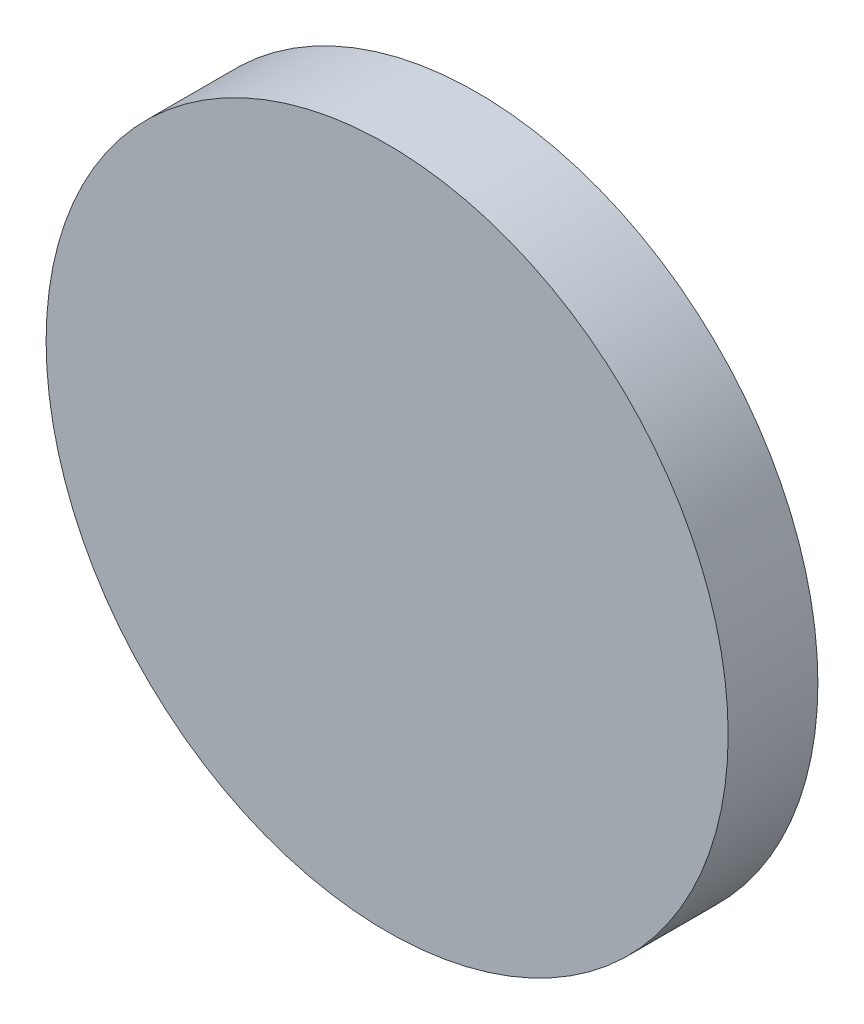
ISO-10303-21;
HEADER;
FILE_DESCRIPTION(('STEP AP214'),'2;1');
FILE_NAME('part.step','',(''),(''),'','','');
FILE_SCHEMA(('AUTOMOTIVE_DESIGN { 1 0 10303 214 1 1 1 1 }'));
ENDSEC;
DATA;
#1=APPLICATION_CONTEXT('core data for automotive mechanical design processes');
#2=APPLICATION_PROTOCOL_DEFINITION('international standard','automotive_design',2000,#1);
#3=PRODUCT_CONTEXT('',#1,'mechanical');
#4=PRODUCT('Part','Part','',(#3));
#5=PRODUCT_RELATED_PRODUCT_CATEGORY('part','',(#4));
#6=PRODUCT_DEFINITION_FORMATION('','',#4);
#7=PRODUCT_DEFINITION_CONTEXT('part definition',#1,'design');
#8=PRODUCT_DEFINITION('design','',#6,#7);
#9=PRODUCT_DEFINITION_SHAPE('','',#8);
#10=(LENGTH_UNIT() NAMED_UNIT(*) SI_UNIT(.MILLI.,.METRE.));
#11=(NAMED_UNIT(*) PLANE_ANGLE_UNIT() SI_UNIT($,.RADIAN.));
#12=(NAMED_UNIT(*) SI_UNIT($,.STERADIAN.) SOLID_ANGLE_UNIT());
#13=UNCERTAINTY_MEASURE_WITH_UNIT(LENGTH_MEASURE(1.E-05),#10,'distance_accuracy_value','');
#14=(GEOMETRIC_REPRESENTATION_CONTEXT(3) GLOBAL_UNCERTAINTY_ASSIGNED_CONTEXT((#13)) GLOBAL_UNIT_ASSIGNED_CONTEXT((#10,
#11,#12)) REPRESENTATION_CONTEXT('',''));
#15=CARTESIAN_POINT('',(0.,0.,0.));
#16=DIRECTION('',(0.,0.,1.));
#17=DIRECTION('',(1.,0.,0.));
#18=AXIS2_PLACEMENT_3D('',#15,#16,#17);
#19=CARTESIAN_POINT('',(-81.1281234244916,39.6078302042042,2.5));
#20=DIRECTION('',(0.,0.,-1.));
#21=DIRECTION('',(-1.,0.,0.));
#22=AXIS2_PLACEMENT_3D('',#19,#20,#21);
#23=CYLINDRICAL_SURFACE('',#22,9.5);
#24=CARTESIAN_POINT('',(-81.1281234244916,39.6078302042042,2.5));
#25=DIRECTION('',(0.,0.,1.));
#26=DIRECTION('',(1.,0.,0.));
#27=AXIS2_PLACEMENT_3D('',#24,#25,#26);
#28=CIRCLE('',#27,9.5);
#29=CARTESIAN_POINT('',(-71.6281234244916,39.6078302042042,2.5));
#30=VERTEX_POINT('',#29);
#31=EDGE_CURVE('E10',#30,#30,#28,.T.);
#32=ORIENTED_EDGE('',*,*,#31,.F.);
#33=EDGE_LOOP('',(#32));
#34=FACE_BOUND('',#33,.T.);
#35=CARTESIAN_POINT('',(-81.1281234244916,39.6078302042042,0.));
#36=DIRECTION('',(0.,0.,1.));
#37=DIRECTION('',(1.,0.,0.));
#38=AXIS2_PLACEMENT_3D('',#35,#36,#37);
#39=CIRCLE('',#38,9.5);
#40=CARTESIAN_POINT('',(-71.6281234244916,39.6078302042042,0.));
#41=VERTEX_POINT('',#40);
#42=EDGE_CURVE('E36',#41,#41,#39,.T.);
#43=ORIENTED_EDGE('',*,*,#42,.T.);
#44=EDGE_LOOP('',(#43));
#45=FACE_BOUND('',#44,.T.);
#46=ADVANCED_FACE('F33',(#34,#45),#23,.T.);
#47=CARTESIAN_POINT('',(-81.1281234244916,39.6078302042042,2.5));
#48=DIRECTION('',(0.,0.,1.));
#49=DIRECTION('',(1.,0.,0.));
#50=AXIS2_PLACEMENT_3D('',#47,#48,#49);
#51=PLANE('',#50);
#52=ORIENTED_EDGE('',*,*,#31,.T.);
#53=EDGE_LOOP('',(#52));
#54=FACE_BOUND('',#53,.T.);
#55=ADVANCED_FACE('F48',(#54),#51,.T.);
#56=CARTESIAN_POINT('',(-81.1281234244916,39.6078302042042,0.));
#57=DIRECTION('',(0.,0.,1.));
#58=DIRECTION('',(1.,0.,0.));
#59=AXIS2_PLACEMENT_3D('',#56,#57,#58);
#60=PLANE('',#59);
#61=ORIENTED_EDGE('',*,*,#42,.F.);
#62=EDGE_LOOP('',(#61));
#63=FACE_BOUND('',#62,.T.);
#64=ADVANCED_FACE('F46',(#63),#60,.F.);
#65=CLOSED_SHELL('',(#46,#55,#64));
#66=MANIFOLD_SOLID_BREP('B2',#65);
#67=ADVANCED_BREP_SHAPE_REPRESENTATION('',(#18,#66),#14);
#68=SHAPE_DEFINITION_REPRESENTATION(#9,#67);
ENDSEC;
END-ISO-10303-21;
